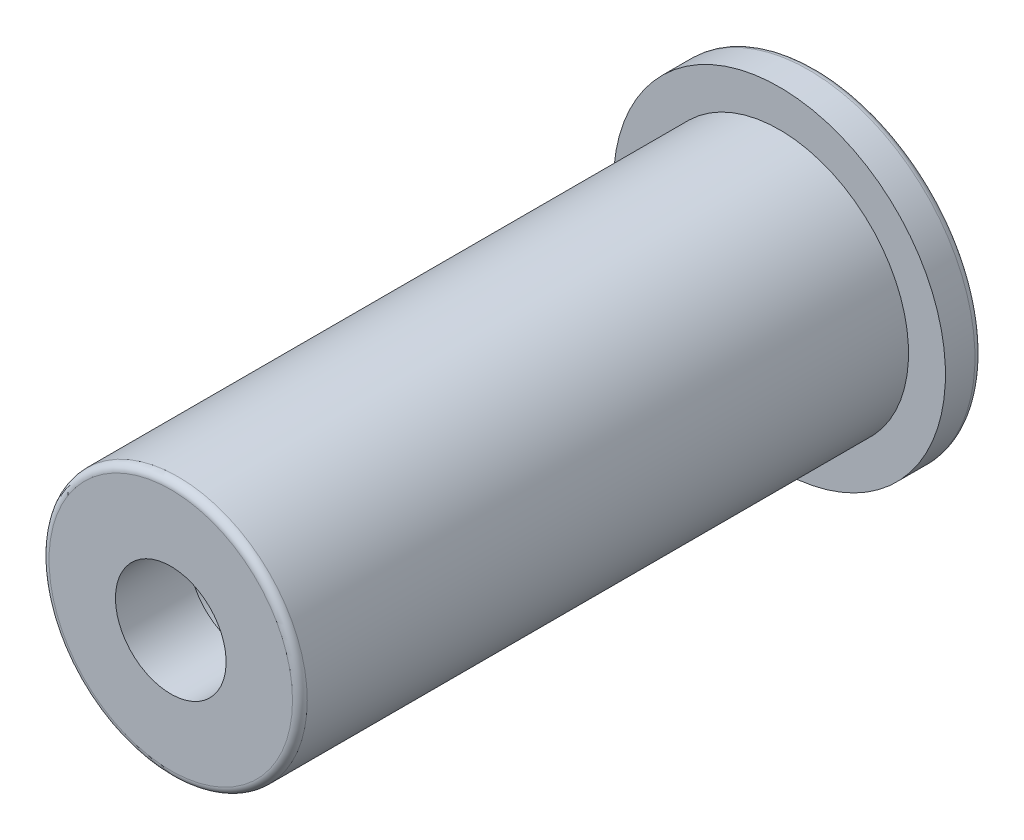
ISO-10303-21;
HEADER;
FILE_DESCRIPTION(('STEP AP214'),'2;1');
FILE_NAME('part.step','',(''),(''),'','','');
FILE_SCHEMA(('AUTOMOTIVE_DESIGN { 1 0 10303 214 1 1 1 1 }'));
ENDSEC;
DATA;
#1=APPLICATION_CONTEXT('core data for automotive mechanical design processes');
#2=APPLICATION_PROTOCOL_DEFINITION('international standard','automotive_design',2000,#1);
#3=PRODUCT_CONTEXT('',#1,'mechanical');
#4=PRODUCT('Part','Part','',(#3));
#5=PRODUCT_RELATED_PRODUCT_CATEGORY('part','',(#4));
#6=PRODUCT_DEFINITION_FORMATION('','',#4);
#7=PRODUCT_DEFINITION_CONTEXT('part definition',#1,'design');
#8=PRODUCT_DEFINITION('design','',#6,#7);
#9=PRODUCT_DEFINITION_SHAPE('','',#8);
#10=(LENGTH_UNIT() NAMED_UNIT(*) SI_UNIT(.MILLI.,.METRE.));
#11=(NAMED_UNIT(*) PLANE_ANGLE_UNIT() SI_UNIT($,.RADIAN.));
#12=(NAMED_UNIT(*) SI_UNIT($,.STERADIAN.) SOLID_ANGLE_UNIT());
#13=UNCERTAINTY_MEASURE_WITH_UNIT(LENGTH_MEASURE(1.E-05),#10,'distance_accuracy_value','');
#14=(GEOMETRIC_REPRESENTATION_CONTEXT(3) GLOBAL_UNCERTAINTY_ASSIGNED_CONTEXT((#13)) GLOBAL_UNIT_ASSIGNED_CONTEXT((#10,
#11,#12)) REPRESENTATION_CONTEXT('',''));
#15=CARTESIAN_POINT('',(0.,0.,0.));
#16=DIRECTION('',(0.,0.,1.));
#17=DIRECTION('',(1.,0.,0.));
#18=AXIS2_PLACEMENT_3D('',#15,#16,#17);
#19=CARTESIAN_POINT('',(0.,0.,-80.9));
#20=DIRECTION('',(0.,0.,-1.));
#21=DIRECTION('',(-1.,0.,0.));
#22=AXIS2_PLACEMENT_3D('',#19,#20,#21);
#23=CYLINDRICAL_SURFACE('',#22,9.);
#24=CARTESIAN_POINT('',(0.,0.,0.399999999999998));
#25=DIRECTION('',(0.,0.,-1.));
#26=DIRECTION('',(-1.,0.,0.));
#27=AXIS2_PLACEMENT_3D('',#24,#25,#26);
#28=CIRCLE('',#27,9.);
#29=CARTESIAN_POINT('',(-9.,0.,0.399999999999998));
#30=VERTEX_POINT('',#29);
#31=EDGE_CURVE('E10',#30,#30,#28,.F.);
#32=ORIENTED_EDGE('',*,*,#31,.T.);
#33=EDGE_LOOP('',(#32));
#34=FACE_BOUND('',#33,.T.);
#35=CARTESIAN_POINT('',(0.,0.,2.));
#36=DIRECTION('',(0.,0.,-1.));
#37=DIRECTION('',(-1.,0.,0.));
#38=AXIS2_PLACEMENT_3D('',#35,#36,#37);
#39=CIRCLE('',#38,9.);
#40=CARTESIAN_POINT('',(-9.,0.,2.));
#41=VERTEX_POINT('',#40);
#42=EDGE_CURVE('E67',#41,#41,#39,.T.);
#43=ORIENTED_EDGE('',*,*,#42,.T.);
#44=EDGE_LOOP('',(#43));
#45=FACE_BOUND('',#44,.T.);
#46=ADVANCED_FACE('F32',(#34,#45),#23,.T.);
#47=CARTESIAN_POINT('',(0.,9.,0.));
#48=DIRECTION('',(0.,0.,-1.));
#49=DIRECTION('',(-1.,0.,0.));
#50=AXIS2_PLACEMENT_3D('',#47,#48,#49);
#51=PLANE('',#50);
#52=CARTESIAN_POINT('',(0.,0.,0.));
#53=DIRECTION('',(0.,0.,-1.));
#54=DIRECTION('',(-1.,0.,0.));
#55=AXIS2_PLACEMENT_3D('',#52,#53,#54);
#56=CIRCLE('',#55,8.6);
#57=CARTESIAN_POINT('',(-8.6,0.,0.));
#58=VERTEX_POINT('',#57);
#59=EDGE_CURVE('E39',#58,#58,#56,.T.);
#60=ORIENTED_EDGE('',*,*,#59,.T.);
#61=EDGE_LOOP('',(#60));
#62=FACE_BOUND('',#61,.T.);
#63=CARTESIAN_POINT('',(0.,0.,0.));
#64=DIRECTION('',(0.,0.,-1.));
#65=DIRECTION('',(-1.,0.,0.));
#66=AXIS2_PLACEMENT_3D('',#63,#64,#65);
#67=CIRCLE('',#66,4.5);
#68=CARTESIAN_POINT('',(-4.5,0.,0.));
#69=VERTEX_POINT('',#68);
#70=EDGE_CURVE('E52',#69,#69,#67,.T.);
#71=ORIENTED_EDGE('',*,*,#70,.F.);
#72=EDGE_LOOP('',(#71));
#73=FACE_BOUND('',#72,.T.);
#74=ADVANCED_FACE('F87',(#62,#73),#51,.T.);
#75=CARTESIAN_POINT('',(0.,0.,-80.9));
#76=DIRECTION('',(0.,0.,-1.));
#77=DIRECTION('',(-1.,0.,0.));
#78=AXIS2_PLACEMENT_3D('',#75,#76,#77);
#79=CYLINDRICAL_SURFACE('',#78,4.5);
#80=ORIENTED_EDGE('',*,*,#70,.T.);
#81=EDGE_LOOP('',(#80));
#82=FACE_BOUND('',#81,.T.);
#83=CARTESIAN_POINT('',(0.,0.,31.));
#84=DIRECTION('',(0.,0.,-1.));
#85=DIRECTION('',(-1.,0.,0.));
#86=AXIS2_PLACEMENT_3D('',#83,#84,#85);
#87=CIRCLE('',#86,4.5);
#88=CARTESIAN_POINT('',(-4.5,0.,31.));
#89=VERTEX_POINT('',#88);
#90=EDGE_CURVE('E55',#89,#89,#87,.T.);
#91=ORIENTED_EDGE('',*,*,#90,.F.);
#92=EDGE_LOOP('',(#91));
#93=FACE_BOUND('',#92,.T.);
#94=ADVANCED_FACE('F92',(#82,#93),#79,.F.);
#95=CARTESIAN_POINT('',(0.,4.5,31.));
#96=DIRECTION('',(0.,0.,-1.));
#97=DIRECTION('',(-1.,0.,0.));
#98=AXIS2_PLACEMENT_3D('',#95,#96,#97);
#99=PLANE('',#98);
#100=ORIENTED_EDGE('',*,*,#90,.T.);
#101=EDGE_LOOP('',(#100));
#102=FACE_BOUND('',#101,.T.);
#103=CARTESIAN_POINT('',(0.,0.,31.));
#104=DIRECTION('',(0.,0.,-1.));
#105=DIRECTION('',(-1.,0.,0.));
#106=AXIS2_PLACEMENT_3D('',#103,#104,#105);
#107=CIRCLE('',#106,3.);
#108=CARTESIAN_POINT('',(-3.,0.,31.));
#109=VERTEX_POINT('',#108);
#110=EDGE_CURVE('E58',#109,#109,#107,.T.);
#111=ORIENTED_EDGE('',*,*,#110,.F.);
#112=EDGE_LOOP('',(#111));
#113=FACE_BOUND('',#112,.T.);
#114=ADVANCED_FACE('F97',(#102,#113),#99,.T.);
#115=CARTESIAN_POINT('',(0.,0.,-80.9));
#116=DIRECTION('',(0.,0.,-1.));
#117=DIRECTION('',(-1.,0.,0.));
#118=AXIS2_PLACEMENT_3D('',#115,#116,#117);
#119=CYLINDRICAL_SURFACE('',#118,3.);
#120=ORIENTED_EDGE('',*,*,#110,.T.);
#121=EDGE_LOOP('',(#120));
#122=FACE_BOUND('',#121,.T.);
#123=CARTESIAN_POINT('',(0.,0.,35.));
#124=DIRECTION('',(0.,0.,-1.));
#125=DIRECTION('',(-1.,0.,0.));
#126=AXIS2_PLACEMENT_3D('',#123,#124,#125);
#127=CIRCLE('',#126,3.);
#128=CARTESIAN_POINT('',(-3.,0.,35.));
#129=VERTEX_POINT('',#128);
#130=EDGE_CURVE('E61',#129,#129,#127,.T.);
#131=ORIENTED_EDGE('',*,*,#130,.F.);
#132=EDGE_LOOP('',(#131));
#133=FACE_BOUND('',#132,.T.);
#134=ADVANCED_FACE('F101',(#122,#133),#119,.F.);
#135=CARTESIAN_POINT('',(0.,3.,35.));
#136=DIRECTION('',(0.,0.,1.));
#137=DIRECTION('',(1.,0.,0.));
#138=AXIS2_PLACEMENT_3D('',#135,#136,#137);
#139=PLANE('',#138);
#140=CARTESIAN_POINT('',(0.,0.,35.));
#141=DIRECTION('',(0.,0.,1.));
#142=DIRECTION('',(1.,0.,0.));
#143=AXIS2_PLACEMENT_3D('',#140,#141,#142);
#144=CIRCLE('',#143,6.6);
#145=CARTESIAN_POINT('',(6.6,0.,35.));
#146=VERTEX_POINT('',#145);
#147=EDGE_CURVE('E43',#146,#146,#144,.T.);
#148=ORIENTED_EDGE('',*,*,#147,.T.);
#149=EDGE_LOOP('',(#148));
#150=FACE_BOUND('',#149,.T.);
#151=ORIENTED_EDGE('',*,*,#130,.T.);
#152=EDGE_LOOP('',(#151));
#153=FACE_BOUND('',#152,.T.);
#154=ADVANCED_FACE('F83',(#150,#153),#139,.T.);
#155=CARTESIAN_POINT('',(0.,0.,-80.9));
#156=DIRECTION('',(0.,0.,-1.));
#157=DIRECTION('',(-1.,0.,0.));
#158=AXIS2_PLACEMENT_3D('',#155,#156,#157);
#159=CYLINDRICAL_SURFACE('',#158,7.);
#160=CARTESIAN_POINT('',(0.,0.,34.6));
#161=DIRECTION('',(0.,0.,1.));
#162=DIRECTION('',(1.,0.,0.));
#163=AXIS2_PLACEMENT_3D('',#160,#161,#162);
#164=CIRCLE('',#163,7.);
#165=CARTESIAN_POINT('',(7.,0.,34.6));
#166=VERTEX_POINT('',#165);
#167=EDGE_CURVE('E47',#166,#166,#164,.F.);
#168=ORIENTED_EDGE('',*,*,#167,.T.);
#169=EDGE_LOOP('',(#168));
#170=FACE_BOUND('',#169,.T.);
#171=CARTESIAN_POINT('',(0.,0.,2.));
#172=DIRECTION('',(0.,0.,-1.));
#173=DIRECTION('',(-1.,0.,0.));
#174=AXIS2_PLACEMENT_3D('',#171,#172,#173);
#175=CIRCLE('',#174,7.);
#176=CARTESIAN_POINT('',(-7.,0.,2.));
#177=VERTEX_POINT('',#176);
#178=EDGE_CURVE('E64',#177,#177,#175,.T.);
#179=ORIENTED_EDGE('',*,*,#178,.F.);
#180=EDGE_LOOP('',(#179));
#181=FACE_BOUND('',#180,.T.);
#182=ADVANCED_FACE('F75',(#170,#181),#159,.T.);
#183=CARTESIAN_POINT('',(0.,7.,2.));
#184=DIRECTION('',(0.,0.,1.));
#185=DIRECTION('',(1.,0.,0.));
#186=AXIS2_PLACEMENT_3D('',#183,#184,#185);
#187=PLANE('',#186);
#188=ORIENTED_EDGE('',*,*,#178,.T.);
#189=EDGE_LOOP('',(#188));
#190=FACE_BOUND('',#189,.T.);
#191=ORIENTED_EDGE('',*,*,#42,.F.);
#192=EDGE_LOOP('',(#191));
#193=FACE_BOUND('',#192,.T.);
#194=ADVANCED_FACE('F72',(#190,#193),#187,.T.);
#195=CARTESIAN_POINT('',(0.,0.,34.6));
#196=DIRECTION('',(0.,0.,1.));
#197=DIRECTION('',(1.,0.,0.));
#198=AXIS2_PLACEMENT_3D('',#195,#196,#197);
#199=TOROIDAL_SURFACE('',#198,6.6,0.4);
#200=ORIENTED_EDGE('',*,*,#147,.F.);
#201=EDGE_LOOP('',(#200));
#202=FACE_BOUND('',#201,.T.);
#203=ORIENTED_EDGE('',*,*,#167,.F.);
#204=EDGE_LOOP('',(#203));
#205=FACE_BOUND('',#204,.T.);
#206=ADVANCED_FACE('F74',(#202,#205),#199,.T.);
#207=CARTESIAN_POINT('',(0.,0.,0.399999999999998));
#208=DIRECTION('',(0.,0.,-1.));
#209=DIRECTION('',(-1.,0.,0.));
#210=AXIS2_PLACEMENT_3D('',#207,#208,#209);
#211=TOROIDAL_SURFACE('',#210,8.6,0.4);
#212=ORIENTED_EDGE('',*,*,#31,.F.);
#213=EDGE_LOOP('',(#212));
#214=FACE_BOUND('',#213,.T.);
#215=ORIENTED_EDGE('',*,*,#59,.F.);
#216=EDGE_LOOP('',(#215));
#217=FACE_BOUND('',#216,.T.);
#218=ADVANCED_FACE('F34',(#214,#217),#211,.T.);
#219=CLOSED_SHELL('',(#46,#74,#94,#114,#134,#154,#182,#194,#206,#218));
#220=MANIFOLD_SOLID_BREP('B2',#219);
#221=ADVANCED_BREP_SHAPE_REPRESENTATION('',(#18,#220),#14);
#222=SHAPE_DEFINITION_REPRESENTATION(#9,#221);
ENDSEC;
END-ISO-10303-21;
